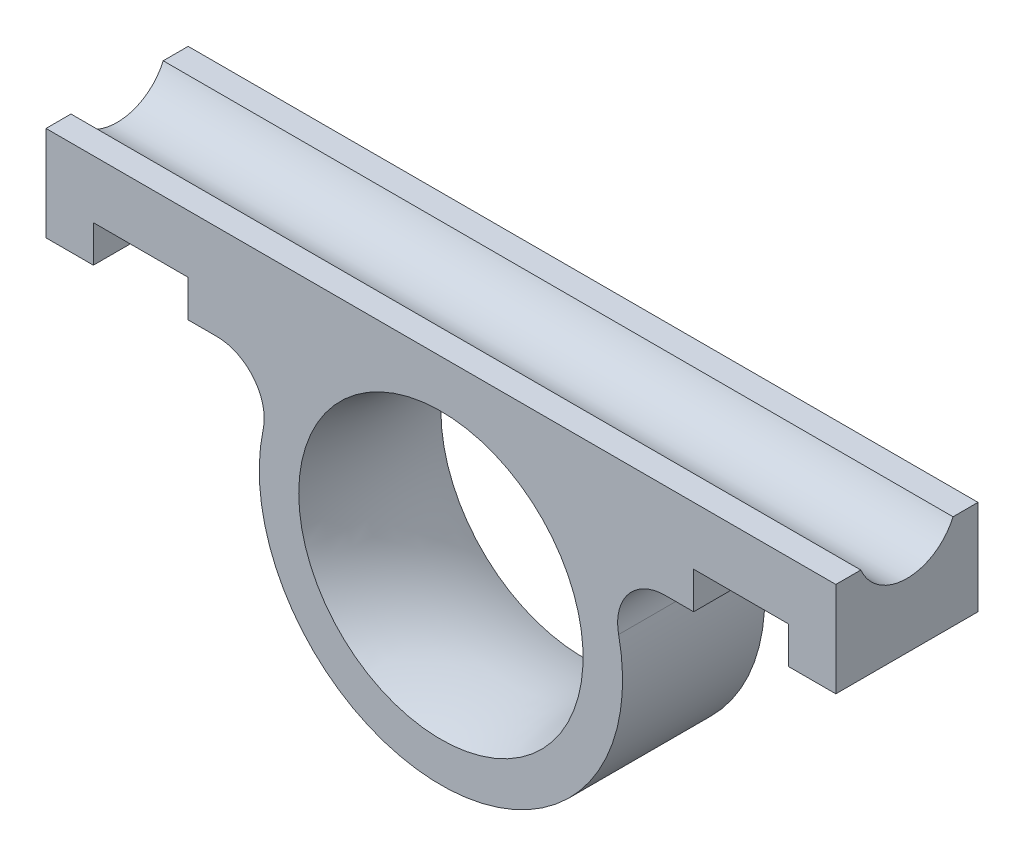
ISO-10303-21;
HEADER;
FILE_DESCRIPTION(('STEP AP214'),'2;1');
FILE_NAME('part.step','',(''),(''),'','','');
FILE_SCHEMA(('AUTOMOTIVE_DESIGN { 1 0 10303 214 1 1 1 1 }'));
ENDSEC;
DATA;
#1=APPLICATION_CONTEXT('core data for automotive mechanical design processes');
#2=APPLICATION_PROTOCOL_DEFINITION('international standard','automotive_design',2000,#1);
#3=PRODUCT_CONTEXT('',#1,'mechanical');
#4=PRODUCT('Part','Part','',(#3));
#5=PRODUCT_RELATED_PRODUCT_CATEGORY('part','',(#4));
#6=PRODUCT_DEFINITION_FORMATION('','',#4);
#7=PRODUCT_DEFINITION_CONTEXT('part definition',#1,'design');
#8=PRODUCT_DEFINITION('design','',#6,#7);
#9=PRODUCT_DEFINITION_SHAPE('','',#8);
#10=(LENGTH_UNIT() NAMED_UNIT(*) SI_UNIT(.MILLI.,.METRE.));
#11=(NAMED_UNIT(*) PLANE_ANGLE_UNIT() SI_UNIT($,.RADIAN.));
#12=(NAMED_UNIT(*) SI_UNIT($,.STERADIAN.) SOLID_ANGLE_UNIT());
#13=UNCERTAINTY_MEASURE_WITH_UNIT(LENGTH_MEASURE(1.E-05),#10,'distance_accuracy_value','');
#14=(GEOMETRIC_REPRESENTATION_CONTEXT(3) GLOBAL_UNCERTAINTY_ASSIGNED_CONTEXT((#13)) GLOBAL_UNIT_ASSIGNED_CONTEXT((#10,
#11,#12)) REPRESENTATION_CONTEXT('',''));
#15=CARTESIAN_POINT('',(0.,0.,0.));
#16=DIRECTION('',(0.,0.,1.));
#17=DIRECTION('',(1.,0.,0.));
#18=AXIS2_PLACEMENT_3D('',#15,#16,#17);
#19=CARTESIAN_POINT('',(-14.1862609591111,3.,9.));
#20=DIRECTION('',(0.,0.,1.));
#21=DIRECTION('',(1.,0.,0.));
#22=AXIS2_PLACEMENT_3D('',#19,#20,#21);
#23=PLANE('',#22);
#24=CARTESIAN_POINT('',(0.,0.,9.));
#25=DIRECTION('',(0.,0.,-1.));
#26=DIRECTION('',(-1.,0.,0.));
#27=AXIS2_PLACEMENT_3D('',#24,#25,#26);
#28=CIRCLE('',#27,9.);
#29=CARTESIAN_POINT('',(-9.,0.,9.));
#30=VERTEX_POINT('',#29);
#31=EDGE_CURVE('E275',#30,#30,#28,.T.);
#32=ORIENTED_EDGE('',*,*,#31,.T.);
#33=EDGE_LOOP('',(#32));
#34=FACE_BOUND('',#33,.T.);
#35=DIRECTION('',(-1.,0.,0.));
#36=VECTOR('',#35,1.);
#37=CARTESIAN_POINT('',(31.2980546704707,8.33534165703035,9.));
#38=LINE('',#37,#36);
#39=CARTESIAN_POINT('',(22.,8.33534165703035,9.));
#40=VERTEX_POINT('',#39);
#41=CARTESIAN_POINT('',(16.,8.33534165703035,9.));
#42=VERTEX_POINT('',#41);
#43=EDGE_CURVE('E261',#40,#42,#38,.T.);
#44=ORIENTED_EDGE('',*,*,#43,.F.);
#45=DIRECTION('',(0.,-1.,0.));
#46=VECTOR('',#45,1.);
#47=CARTESIAN_POINT('',(22.,7.00000000000001,9.));
#48=LINE('',#47,#46);
#49=CARTESIAN_POINT('',(22.,6.00000000000001,9.));
#50=VERTEX_POINT('',#49);
#51=EDGE_CURVE('E145',#40,#50,#48,.T.);
#52=ORIENTED_EDGE('',*,*,#51,.T.);
#53=DIRECTION('',(1.,0.,0.));
#54=VECTOR('',#53,1.);
#55=CARTESIAN_POINT('',(22.,6.00000000000001,9.));
#56=LINE('',#55,#54);
#57=CARTESIAN_POINT('',(25.,6.00000000000001,9.));
#58=VERTEX_POINT('',#57);
#59=EDGE_CURVE('E138',#50,#58,#56,.T.);
#60=ORIENTED_EDGE('',*,*,#59,.T.);
#61=DIRECTION('',(0.,1.,0.));
#62=VECTOR('',#61,1.);
#63=CARTESIAN_POINT('',(25.,12.,9.));
#64=LINE('',#63,#62);
#65=CARTESIAN_POINT('',(25.,12.,9.));
#66=VERTEX_POINT('',#65);
#67=EDGE_CURVE('E142',#58,#66,#64,.T.);
#68=ORIENTED_EDGE('',*,*,#67,.T.);
#69=DIRECTION('',(-1.,0.,0.));
#70=VECTOR('',#69,1.);
#71=CARTESIAN_POINT('',(-25.,12.,9.));
#72=LINE('',#71,#70);
#73=CARTESIAN_POINT('',(-25.,12.,9.));
#74=VERTEX_POINT('',#73);
#75=EDGE_CURVE('E57',#66,#74,#72,.T.);
#76=ORIENTED_EDGE('',*,*,#75,.T.);
#77=DIRECTION('',(0.,-1.,0.));
#78=VECTOR('',#77,1.);
#79=CARTESIAN_POINT('',(-25.,12.,9.));
#80=LINE('',#79,#78);
#81=CARTESIAN_POINT('',(-25.,6.,9.));
#82=VERTEX_POINT('',#81);
#83=EDGE_CURVE('E198',#74,#82,#80,.T.);
#84=ORIENTED_EDGE('',*,*,#83,.T.);
#85=DIRECTION('',(1.,0.,0.));
#86=VECTOR('',#85,1.);
#87=CARTESIAN_POINT('',(-25.,6.,9.));
#88=LINE('',#87,#86);
#89=CARTESIAN_POINT('',(-22.,6.,9.));
#90=VERTEX_POINT('',#89);
#91=EDGE_CURVE('E111',#82,#90,#88,.T.);
#92=ORIENTED_EDGE('',*,*,#91,.T.);
#93=DIRECTION('',(0.,1.,0.));
#94=VECTOR('',#93,1.);
#95=CARTESIAN_POINT('',(-22.,6.,9.));
#96=LINE('',#95,#94);
#97=CARTESIAN_POINT('',(-22.,8.33534165703034,9.));
#98=VERTEX_POINT('',#97);
#99=EDGE_CURVE('E234',#90,#98,#96,.T.);
#100=ORIENTED_EDGE('',*,*,#99,.T.);
#101=DIRECTION('',(-1.,0.,0.));
#102=VECTOR('',#101,1.);
#103=CARTESIAN_POINT('',(23.0812579761706,8.33534165703042,9.));
#104=LINE('',#103,#102);
#105=CARTESIAN_POINT('',(-16.,8.33534165703035,9.));
#106=VERTEX_POINT('',#105);
#107=EDGE_CURVE('E295',#106,#98,#104,.T.);
#108=ORIENTED_EDGE('',*,*,#107,.F.);
#109=DIRECTION('',(0.,-1.,0.));
#110=VECTOR('',#109,1.);
#111=CARTESIAN_POINT('',(-16.,7.,9.));
#112=LINE('',#111,#110);
#113=CARTESIAN_POINT('',(-16.,6.,9.));
#114=VERTEX_POINT('',#113);
#115=EDGE_CURVE('E242',#106,#114,#112,.T.);
#116=ORIENTED_EDGE('',*,*,#115,.T.);
#117=DIRECTION('',(1.,0.,0.));
#118=VECTOR('',#117,1.);
#119=CARTESIAN_POINT('',(-16.,6.,9.));
#120=LINE('',#119,#118);
#121=CARTESIAN_POINT('',(-14.1862609591111,6.,9.));
#122=VERTEX_POINT('',#121);
#123=EDGE_CURVE('E244',#114,#122,#120,.T.);
#124=ORIENTED_EDGE('',*,*,#123,.T.);
#125=CARTESIAN_POINT('',(-14.1862609591111,3.,9.));
#126=DIRECTION('',(0.,0.,-1.));
#127=DIRECTION('',(1.,0.,0.));
#128=AXIS2_PLACEMENT_3D('',#125,#126,#127);
#129=CIRCLE('',#128,3.);
#130=CARTESIAN_POINT('',(-11.2511724848123,2.37931034482759,9.));
#131=VERTEX_POINT('',#130);
#132=EDGE_CURVE('E246',#122,#131,#129,.T.);
#133=ORIENTED_EDGE('',*,*,#132,.T.);
#134=CARTESIAN_POINT('',(0.,0.,9.));
#135=DIRECTION('',(0.,0.,1.));
#136=DIRECTION('',(1.,0.,0.));
#137=AXIS2_PLACEMENT_3D('',#134,#135,#136);
#138=CIRCLE('',#137,11.5);
#139=CARTESIAN_POINT('',(11.2511724848123,2.37931034482759,9.));
#140=VERTEX_POINT('',#139);
#141=EDGE_CURVE('E248',#131,#140,#138,.T.);
#142=ORIENTED_EDGE('',*,*,#141,.T.);
#143=CARTESIAN_POINT('',(14.1862609591111,3.,9.));
#144=DIRECTION('',(0.,0.,-1.));
#145=DIRECTION('',(1.,0.,0.));
#146=AXIS2_PLACEMENT_3D('',#143,#144,#145);
#147=CIRCLE('',#146,3.);
#148=CARTESIAN_POINT('',(14.1862609591111,6.,9.));
#149=VERTEX_POINT('',#148);
#150=EDGE_CURVE('E250',#140,#149,#147,.T.);
#151=ORIENTED_EDGE('',*,*,#150,.T.);
#152=DIRECTION('',(1.,0.,0.));
#153=VECTOR('',#152,1.);
#154=CARTESIAN_POINT('',(14.1862609591111,6.,9.));
#155=LINE('',#154,#153);
#156=CARTESIAN_POINT('',(16.,6.,9.));
#157=VERTEX_POINT('',#156);
#158=EDGE_CURVE('E252',#149,#157,#155,.T.);
#159=ORIENTED_EDGE('',*,*,#158,.T.);
#160=DIRECTION('',(0.,1.,0.));
#161=VECTOR('',#160,1.);
#162=CARTESIAN_POINT('',(16.,6.,9.));
#163=LINE('',#162,#161);
#164=EDGE_CURVE('E254',#157,#42,#163,.T.);
#165=ORIENTED_EDGE('',*,*,#164,.T.);
#166=EDGE_LOOP('',(#44,#52,#60,#68,#76,#84,#92,#100,#108,#116,#124,#133,#142,#151,#159,#165));
#167=FACE_BOUND('',#166,.T.);
#168=ADVANCED_FACE('F33',(#34,#167),#23,.T.);
#169=CARTESIAN_POINT('',(-14.1862609591111,3.,0.));
#170=DIRECTION('',(0.,0.,1.));
#171=DIRECTION('',(1.,0.,0.));
#172=AXIS2_PLACEMENT_3D('',#169,#170,#171);
#173=PLANE('',#172);
#174=CARTESIAN_POINT('',(0.,0.,0.));
#175=DIRECTION('',(0.,0.,-1.));
#176=DIRECTION('',(-1.,0.,0.));
#177=AXIS2_PLACEMENT_3D('',#174,#175,#176);
#178=CIRCLE('',#177,9.);
#179=CARTESIAN_POINT('',(-9.,0.,0.));
#180=VERTEX_POINT('',#179);
#181=EDGE_CURVE('E415',#180,#180,#178,.T.);
#182=ORIENTED_EDGE('',*,*,#181,.F.);
#183=EDGE_LOOP('',(#182));
#184=FACE_BOUND('',#183,.T.);
#185=DIRECTION('',(0.,-1.,0.));
#186=VECTOR('',#185,1.);
#187=CARTESIAN_POINT('',(22.,7.00000000000001,0.));
#188=LINE('',#187,#186);
#189=CARTESIAN_POINT('',(22.,8.33534165703035,0.));
#190=VERTEX_POINT('',#189);
#191=CARTESIAN_POINT('',(22.,6.00000000000001,0.));
#192=VERTEX_POINT('',#191);
#193=EDGE_CURVE('E191',#190,#192,#188,.T.);
#194=ORIENTED_EDGE('',*,*,#193,.F.);
#195=DIRECTION('',(-1.,0.,0.));
#196=VECTOR('',#195,1.);
#197=CARTESIAN_POINT('',(31.2980546704707,8.33534165703035,0.));
#198=LINE('',#197,#196);
#199=CARTESIAN_POINT('',(16.,8.33534165703035,0.));
#200=VERTEX_POINT('',#199);
#201=EDGE_CURVE('E282',#190,#200,#198,.T.);
#202=ORIENTED_EDGE('',*,*,#201,.T.);
#203=DIRECTION('',(0.,1.,0.));
#204=VECTOR('',#203,1.);
#205=CARTESIAN_POINT('',(16.,6.,0.));
#206=LINE('',#205,#204);
#207=CARTESIAN_POINT('',(16.,6.,0.));
#208=VERTEX_POINT('',#207);
#209=EDGE_CURVE('E188',#208,#200,#206,.T.);
#210=ORIENTED_EDGE('',*,*,#209,.F.);
#211=DIRECTION('',(1.,0.,0.));
#212=VECTOR('',#211,1.);
#213=CARTESIAN_POINT('',(14.1862609591111,6.,0.));
#214=LINE('',#213,#212);
#215=CARTESIAN_POINT('',(14.1862609591111,6.,0.));
#216=VERTEX_POINT('',#215);
#217=EDGE_CURVE('E186',#216,#208,#214,.T.);
#218=ORIENTED_EDGE('',*,*,#217,.F.);
#219=CARTESIAN_POINT('',(14.1862609591111,3.,0.));
#220=DIRECTION('',(0.,0.,-1.));
#221=DIRECTION('',(1.,0.,0.));
#222=AXIS2_PLACEMENT_3D('',#219,#220,#221);
#223=CIRCLE('',#222,3.);
#224=CARTESIAN_POINT('',(11.2511724848123,2.37931034482759,0.));
#225=VERTEX_POINT('',#224);
#226=EDGE_CURVE('E184',#225,#216,#223,.T.);
#227=ORIENTED_EDGE('',*,*,#226,.F.);
#228=CARTESIAN_POINT('',(0.,0.,0.));
#229=DIRECTION('',(0.,0.,1.));
#230=DIRECTION('',(1.,0.,0.));
#231=AXIS2_PLACEMENT_3D('',#228,#229,#230);
#232=CIRCLE('',#231,11.5);
#233=CARTESIAN_POINT('',(-11.2511724848123,2.37931034482759,0.));
#234=VERTEX_POINT('',#233);
#235=EDGE_CURVE('E182',#234,#225,#232,.T.);
#236=ORIENTED_EDGE('',*,*,#235,.F.);
#237=CARTESIAN_POINT('',(-14.1862609591111,3.,0.));
#238=DIRECTION('',(0.,0.,-1.));
#239=DIRECTION('',(1.,0.,0.));
#240=AXIS2_PLACEMENT_3D('',#237,#238,#239);
#241=CIRCLE('',#240,3.);
#242=CARTESIAN_POINT('',(-14.1862609591111,6.,0.));
#243=VERTEX_POINT('',#242);
#244=EDGE_CURVE('E180',#243,#234,#241,.T.);
#245=ORIENTED_EDGE('',*,*,#244,.F.);
#246=DIRECTION('',(1.,0.,0.));
#247=VECTOR('',#246,1.);
#248=CARTESIAN_POINT('',(-16.,6.,0.));
#249=LINE('',#248,#247);
#250=CARTESIAN_POINT('',(-16.,6.,0.));
#251=VERTEX_POINT('',#250);
#252=EDGE_CURVE('E178',#251,#243,#249,.T.);
#253=ORIENTED_EDGE('',*,*,#252,.F.);
#254=DIRECTION('',(0.,-1.,0.));
#255=VECTOR('',#254,1.);
#256=CARTESIAN_POINT('',(-16.,7.,0.));
#257=LINE('',#256,#255);
#258=CARTESIAN_POINT('',(-16.,8.33534165703035,0.));
#259=VERTEX_POINT('',#258);
#260=EDGE_CURVE('E176',#259,#251,#257,.T.);
#261=ORIENTED_EDGE('',*,*,#260,.F.);
#262=DIRECTION('',(-1.,0.,0.));
#263=VECTOR('',#262,1.);
#264=CARTESIAN_POINT('',(23.0812579761706,8.33534165703042,0.));
#265=LINE('',#264,#263);
#266=CARTESIAN_POINT('',(-22.,8.33534165703034,0.));
#267=VERTEX_POINT('',#266);
#268=EDGE_CURVE('E290',#259,#267,#265,.T.);
#269=ORIENTED_EDGE('',*,*,#268,.T.);
#270=DIRECTION('',(0.,1.,0.));
#271=VECTOR('',#270,1.);
#272=CARTESIAN_POINT('',(-22.,6.,0.));
#273=LINE('',#272,#271);
#274=CARTESIAN_POINT('',(-22.,6.,0.));
#275=VERTEX_POINT('',#274);
#276=EDGE_CURVE('E173',#275,#267,#273,.T.);
#277=ORIENTED_EDGE('',*,*,#276,.F.);
#278=DIRECTION('',(1.,0.,0.));
#279=VECTOR('',#278,1.);
#280=CARTESIAN_POINT('',(-25.,6.,0.));
#281=LINE('',#280,#279);
#282=CARTESIAN_POINT('',(-25.,6.,0.));
#283=VERTEX_POINT('',#282);
#284=EDGE_CURVE('E171',#283,#275,#281,.T.);
#285=ORIENTED_EDGE('',*,*,#284,.F.);
#286=DIRECTION('',(0.,-1.,0.));
#287=VECTOR('',#286,1.);
#288=CARTESIAN_POINT('',(-25.,12.,0.));
#289=LINE('',#288,#287);
#290=CARTESIAN_POINT('',(-25.,12.,0.));
#291=VERTEX_POINT('',#290);
#292=EDGE_CURVE('E169',#291,#283,#289,.T.);
#293=ORIENTED_EDGE('',*,*,#292,.F.);
#294=DIRECTION('',(-1.,0.,0.));
#295=VECTOR('',#294,1.);
#296=CARTESIAN_POINT('',(-25.,12.,0.));
#297=LINE('',#296,#295);
#298=CARTESIAN_POINT('',(25.,12.,0.));
#299=VERTEX_POINT('',#298);
#300=EDGE_CURVE('E196',#299,#291,#297,.T.);
#301=ORIENTED_EDGE('',*,*,#300,.F.);
#302=DIRECTION('',(0.,1.,0.));
#303=VECTOR('',#302,1.);
#304=CARTESIAN_POINT('',(25.,12.,0.));
#305=LINE('',#304,#303);
#306=CARTESIAN_POINT('',(25.,6.00000000000001,0.));
#307=VERTEX_POINT('',#306);
#308=EDGE_CURVE('E194',#307,#299,#305,.T.);
#309=ORIENTED_EDGE('',*,*,#308,.F.);
#310=DIRECTION('',(1.,0.,0.));
#311=VECTOR('',#310,1.);
#312=CARTESIAN_POINT('',(22.,6.00000000000001,0.));
#313=LINE('',#312,#311);
#314=EDGE_CURVE('E154',#192,#307,#313,.T.);
#315=ORIENTED_EDGE('',*,*,#314,.F.);
#316=EDGE_LOOP('',(#194,#202,#210,#218,#227,#236,#245,#253,#261,#269,#277,#285,#293,#301,#309,#315));
#317=FACE_BOUND('',#316,.T.);
#318=ADVANCED_FACE('F305',(#184,#317),#173,.F.);
#319=CARTESIAN_POINT('',(-25.,12.,9.));
#320=DIRECTION('',(0.,-1.,0.));
#321=DIRECTION('',(1.,0.,0.));
#322=AXIS2_PLACEMENT_3D('',#319,#320,#321);
#323=PLANE('',#322);
#324=DIRECTION('',(0.,0.,-1.));
#325=VECTOR('',#324,1.);
#326=CARTESIAN_POINT('',(-25.,12.,9.));
#327=LINE('',#326,#325);
#328=CARTESIAN_POINT('',(-25.,12.,1.58141729601507));
#329=VERTEX_POINT('',#328);
#330=EDGE_CURVE('E102',#329,#291,#327,.T.);
#331=ORIENTED_EDGE('',*,*,#330,.F.);
#332=DIRECTION('',(1.,0.,0.));
#333=VECTOR('',#332,1.);
#334=CARTESIAN_POINT('',(-25.,12.,1.58141729601507));
#335=LINE('',#334,#333);
#336=CARTESIAN_POINT('',(25.,12.,1.58141729601507));
#337=VERTEX_POINT('',#336);
#338=EDGE_CURVE('E12',#329,#337,#335,.T.);
#339=ORIENTED_EDGE('',*,*,#338,.T.);
#340=DIRECTION('',(0.,0.,-1.));
#341=VECTOR('',#340,1.);
#342=CARTESIAN_POINT('',(25.,12.,9.));
#343=LINE('',#342,#341);
#344=EDGE_CURVE('E202',#337,#299,#343,.T.);
#345=ORIENTED_EDGE('',*,*,#344,.T.);
#346=ORIENTED_EDGE('',*,*,#300,.T.);
#347=EDGE_LOOP('',(#331,#339,#345,#346));
#348=FACE_BOUND('',#347,.T.);
#349=ADVANCED_FACE('F300',(#348),#323,.F.);
#350=CARTESIAN_POINT('',(-25.,12.,9.));
#351=DIRECTION('',(1.,0.,0.));
#352=DIRECTION('',(0.,0.,-1.));
#353=AXIS2_PLACEMENT_3D('',#350,#351,#352);
#354=PLANE('',#353);
#355=CARTESIAN_POINT('',(-25.,12.,7.41858270398493));
#356=VERTEX_POINT('',#355);
#357=EDGE_CURVE('E199',#74,#356,#327,.T.);
#358=ORIENTED_EDGE('',*,*,#357,.T.);
#359=CARTESIAN_POINT('',(-25.,13.25,4.5));
#360=DIRECTION('',(1.,0.,0.));
#361=DIRECTION('',(0.,0.,-1.));
#362=AXIS2_PLACEMENT_3D('',#359,#360,#361);
#363=CIRCLE('',#362,3.175);
#364=EDGE_CURVE('E48',#356,#329,#363,.T.);
#365=ORIENTED_EDGE('',*,*,#364,.T.);
#366=ORIENTED_EDGE('',*,*,#330,.T.);
#367=ORIENTED_EDGE('',*,*,#292,.T.);
#368=DIRECTION('',(0.,0.,-1.));
#369=VECTOR('',#368,1.);
#370=CARTESIAN_POINT('',(-25.,6.,9.));
#371=LINE('',#370,#369);
#372=EDGE_CURVE('E226',#82,#283,#371,.T.);
#373=ORIENTED_EDGE('',*,*,#372,.F.);
#374=ORIENTED_EDGE('',*,*,#83,.F.);
#375=EDGE_LOOP('',(#358,#365,#366,#367,#373,#374));
#376=FACE_BOUND('',#375,.T.);
#377=ADVANCED_FACE('F35',(#376),#354,.F.);
#378=CARTESIAN_POINT('',(-25.,6.,9.));
#379=DIRECTION('',(0.,1.,0.));
#380=DIRECTION('',(0.,0.,1.));
#381=AXIS2_PLACEMENT_3D('',#378,#379,#380);
#382=PLANE('',#381);
#383=ORIENTED_EDGE('',*,*,#284,.T.);
#384=DIRECTION('',(0.,0.,-1.));
#385=VECTOR('',#384,1.);
#386=CARTESIAN_POINT('',(-22.,6.,9.));
#387=LINE('',#386,#385);
#388=EDGE_CURVE('E223',#90,#275,#387,.T.);
#389=ORIENTED_EDGE('',*,*,#388,.F.);
#390=ORIENTED_EDGE('',*,*,#91,.F.);
#391=ORIENTED_EDGE('',*,*,#372,.T.);
#392=EDGE_LOOP('',(#383,#389,#390,#391));
#393=FACE_BOUND('',#392,.T.);
#394=ADVANCED_FACE('F307',(#393),#382,.F.);
#395=CARTESIAN_POINT('',(-22.,6.,9.));
#396=DIRECTION('',(-1.,0.,0.));
#397=DIRECTION('',(0.,-1.,0.));
#398=AXIS2_PLACEMENT_3D('',#395,#396,#397);
#399=PLANE('',#398);
#400=ORIENTED_EDGE('',*,*,#276,.T.);
#401=CARTESIAN_POINT('',(-22.,15.25,4.5));
#402=DIRECTION('',(1.,0.,0.));
#403=DIRECTION('',(0.,1.,0.));
#404=AXIS2_PLACEMENT_3D('',#401,#402,#403);
#405=CIRCLE('',#404,8.24999999999997);
#406=EDGE_CURVE('E287',#98,#267,#405,.T.);
#407=ORIENTED_EDGE('',*,*,#406,.F.);
#408=ORIENTED_EDGE('',*,*,#99,.F.);
#409=ORIENTED_EDGE('',*,*,#388,.T.);
#410=EDGE_LOOP('',(#400,#407,#408,#409));
#411=FACE_BOUND('',#410,.T.);
#412=ADVANCED_FACE('F309',(#411),#399,.F.);
#413=CARTESIAN_POINT('',(-16.,7.,9.));
#414=DIRECTION('',(1.,0.,0.));
#415=DIRECTION('',(0.,0.,-1.));
#416=AXIS2_PLACEMENT_3D('',#413,#414,#415);
#417=PLANE('',#416);
#418=ORIENTED_EDGE('',*,*,#260,.T.);
#419=DIRECTION('',(0.,0.,-1.));
#420=VECTOR('',#419,1.);
#421=CARTESIAN_POINT('',(-16.,6.,9.));
#422=LINE('',#421,#420);
#423=EDGE_CURVE('E220',#114,#251,#422,.T.);
#424=ORIENTED_EDGE('',*,*,#423,.F.);
#425=ORIENTED_EDGE('',*,*,#115,.F.);
#426=CARTESIAN_POINT('',(-16.,15.25,4.5));
#427=DIRECTION('',(1.,0.,0.));
#428=DIRECTION('',(0.,0.,-1.));
#429=AXIS2_PLACEMENT_3D('',#426,#427,#428);
#430=CIRCLE('',#429,8.24999999999997);
#431=EDGE_CURVE('E286',#106,#259,#430,.T.);
#432=ORIENTED_EDGE('',*,*,#431,.T.);
#433=EDGE_LOOP('',(#418,#424,#425,#432));
#434=FACE_BOUND('',#433,.T.);
#435=ADVANCED_FACE('F314',(#434),#417,.F.);
#436=CARTESIAN_POINT('',(-16.,6.,9.));
#437=DIRECTION('',(0.,1.,0.));
#438=DIRECTION('',(-1.,0.,0.));
#439=AXIS2_PLACEMENT_3D('',#436,#437,#438);
#440=PLANE('',#439);
#441=ORIENTED_EDGE('',*,*,#252,.T.);
#442=DIRECTION('',(0.,0.,-1.));
#443=VECTOR('',#442,1.);
#444=CARTESIAN_POINT('',(-14.1862609591111,6.,9.));
#445=LINE('',#444,#443);
#446=EDGE_CURVE('E217',#122,#243,#445,.T.);
#447=ORIENTED_EDGE('',*,*,#446,.F.);
#448=ORIENTED_EDGE('',*,*,#123,.F.);
#449=ORIENTED_EDGE('',*,*,#423,.T.);
#450=EDGE_LOOP('',(#441,#447,#448,#449));
#451=FACE_BOUND('',#450,.T.);
#452=ADVANCED_FACE('F356',(#451),#440,.F.);
#453=CARTESIAN_POINT('',(-14.1862609591111,3.,9.));
#454=DIRECTION('',(0.,0.,-1.));
#455=DIRECTION('',(-1.,0.,0.));
#456=AXIS2_PLACEMENT_3D('',#453,#454,#455);
#457=CYLINDRICAL_SURFACE('',#456,3.);
#458=ORIENTED_EDGE('',*,*,#244,.T.);
#459=DIRECTION('',(0.,0.,-1.));
#460=VECTOR('',#459,1.);
#461=CARTESIAN_POINT('',(-11.2511724848123,2.37931034482759,9.));
#462=LINE('',#461,#460);
#463=EDGE_CURVE('E214',#131,#234,#462,.T.);
#464=ORIENTED_EDGE('',*,*,#463,.F.);
#465=ORIENTED_EDGE('',*,*,#132,.F.);
#466=ORIENTED_EDGE('',*,*,#446,.T.);
#467=EDGE_LOOP('',(#458,#464,#465,#466));
#468=FACE_BOUND('',#467,.T.);
#469=ADVANCED_FACE('F352',(#468),#457,.F.);
#470=CARTESIAN_POINT('',(0.,0.,9.));
#471=DIRECTION('',(0.,0.,-1.));
#472=DIRECTION('',(-1.,0.,0.));
#473=AXIS2_PLACEMENT_3D('',#470,#471,#472);
#474=CYLINDRICAL_SURFACE('',#473,11.5);
#475=ORIENTED_EDGE('',*,*,#235,.T.);
#476=DIRECTION('',(0.,0.,-1.));
#477=VECTOR('',#476,1.);
#478=CARTESIAN_POINT('',(11.2511724848123,2.37931034482759,9.));
#479=LINE('',#478,#477);
#480=EDGE_CURVE('E211',#140,#225,#479,.T.);
#481=ORIENTED_EDGE('',*,*,#480,.F.);
#482=ORIENTED_EDGE('',*,*,#141,.F.);
#483=ORIENTED_EDGE('',*,*,#463,.T.);
#484=EDGE_LOOP('',(#475,#481,#482,#483));
#485=FACE_BOUND('',#484,.T.);
#486=ADVANCED_FACE('F348',(#485),#474,.T.);
#487=CARTESIAN_POINT('',(14.1862609591111,3.,9.));
#488=DIRECTION('',(0.,0.,-1.));
#489=DIRECTION('',(-1.,0.,0.));
#490=AXIS2_PLACEMENT_3D('',#487,#488,#489);
#491=CYLINDRICAL_SURFACE('',#490,3.);
#492=ORIENTED_EDGE('',*,*,#226,.T.);
#493=DIRECTION('',(0.,0.,-1.));
#494=VECTOR('',#493,1.);
#495=CARTESIAN_POINT('',(14.1862609591111,6.,9.));
#496=LINE('',#495,#494);
#497=EDGE_CURVE('E208',#149,#216,#496,.T.);
#498=ORIENTED_EDGE('',*,*,#497,.F.);
#499=ORIENTED_EDGE('',*,*,#150,.F.);
#500=ORIENTED_EDGE('',*,*,#480,.T.);
#501=EDGE_LOOP('',(#492,#498,#499,#500));
#502=FACE_BOUND('',#501,.T.);
#503=ADVANCED_FACE('F344',(#502),#491,.F.);
#504=CARTESIAN_POINT('',(14.1862609591111,6.,9.));
#505=DIRECTION('',(0.,1.,0.));
#506=DIRECTION('',(-1.,0.,0.));
#507=AXIS2_PLACEMENT_3D('',#504,#505,#506);
#508=PLANE('',#507);
#509=ORIENTED_EDGE('',*,*,#217,.T.);
#510=DIRECTION('',(0.,0.,-1.));
#511=VECTOR('',#510,1.);
#512=CARTESIAN_POINT('',(16.,6.,9.));
#513=LINE('',#512,#511);
#514=EDGE_CURVE('E205',#157,#208,#513,.T.);
#515=ORIENTED_EDGE('',*,*,#514,.F.);
#516=ORIENTED_EDGE('',*,*,#158,.F.);
#517=ORIENTED_EDGE('',*,*,#497,.T.);
#518=EDGE_LOOP('',(#509,#515,#516,#517));
#519=FACE_BOUND('',#518,.T.);
#520=ADVANCED_FACE('F341',(#519),#508,.F.);
#521=CARTESIAN_POINT('',(16.,6.,9.));
#522=DIRECTION('',(-1.,0.,0.));
#523=DIRECTION('',(0.,0.,1.));
#524=AXIS2_PLACEMENT_3D('',#521,#522,#523);
#525=PLANE('',#524);
#526=ORIENTED_EDGE('',*,*,#209,.T.);
#527=CARTESIAN_POINT('',(16.,15.25,4.5));
#528=DIRECTION('',(1.,0.,0.));
#529=DIRECTION('',(0.,0.,1.));
#530=AXIS2_PLACEMENT_3D('',#527,#528,#529);
#531=CIRCLE('',#530,8.24999999999997);
#532=EDGE_CURVE('E269',#42,#200,#531,.T.);
#533=ORIENTED_EDGE('',*,*,#532,.F.);
#534=ORIENTED_EDGE('',*,*,#164,.F.);
#535=ORIENTED_EDGE('',*,*,#514,.T.);
#536=EDGE_LOOP('',(#526,#533,#534,#535));
#537=FACE_BOUND('',#536,.T.);
#538=ADVANCED_FACE('F270',(#537),#525,.F.);
#539=CARTESIAN_POINT('',(22.,7.00000000000001,9.));
#540=DIRECTION('',(1.,0.,0.));
#541=DIRECTION('',(0.,1.,0.));
#542=AXIS2_PLACEMENT_3D('',#539,#540,#541);
#543=PLANE('',#542);
#544=ORIENTED_EDGE('',*,*,#193,.T.);
#545=DIRECTION('',(0.,0.,-1.));
#546=VECTOR('',#545,1.);
#547=CARTESIAN_POINT('',(22.,6.00000000000001,9.));
#548=LINE('',#547,#546);
#549=EDGE_CURVE('E158',#50,#192,#548,.T.);
#550=ORIENTED_EDGE('',*,*,#549,.F.);
#551=ORIENTED_EDGE('',*,*,#51,.F.);
#552=CARTESIAN_POINT('',(22.,15.25,4.5));
#553=DIRECTION('',(1.,0.,0.));
#554=DIRECTION('',(0.,1.,0.));
#555=AXIS2_PLACEMENT_3D('',#552,#553,#554);
#556=CIRCLE('',#555,8.24999999999997);
#557=EDGE_CURVE('E280',#40,#190,#556,.T.);
#558=ORIENTED_EDGE('',*,*,#557,.T.);
#559=EDGE_LOOP('',(#544,#550,#551,#558));
#560=FACE_BOUND('',#559,.T.);
#561=ADVANCED_FACE('F335',(#560),#543,.F.);
#562=CARTESIAN_POINT('',(22.,6.00000000000001,9.));
#563=DIRECTION('',(0.,1.,0.));
#564=DIRECTION('',(-1.,0.,0.));
#565=AXIS2_PLACEMENT_3D('',#562,#563,#564);
#566=PLANE('',#565);
#567=ORIENTED_EDGE('',*,*,#314,.T.);
#568=DIRECTION('',(0.,0.,-1.));
#569=VECTOR('',#568,1.);
#570=CARTESIAN_POINT('',(25.,6.00000000000001,9.));
#571=LINE('',#570,#569);
#572=EDGE_CURVE('E151',#58,#307,#571,.T.);
#573=ORIENTED_EDGE('',*,*,#572,.F.);
#574=ORIENTED_EDGE('',*,*,#59,.F.);
#575=ORIENTED_EDGE('',*,*,#549,.T.);
#576=EDGE_LOOP('',(#567,#573,#574,#575));
#577=FACE_BOUND('',#576,.T.);
#578=ADVANCED_FACE('F152',(#577),#566,.F.);
#579=CARTESIAN_POINT('',(25.,12.,9.));
#580=DIRECTION('',(-1.,0.,0.));
#581=DIRECTION('',(0.,0.,1.));
#582=AXIS2_PLACEMENT_3D('',#579,#580,#581);
#583=PLANE('',#582);
#584=ORIENTED_EDGE('',*,*,#344,.F.);
#585=CARTESIAN_POINT('',(25.,13.25,4.5));
#586=DIRECTION('',(1.,0.,0.));
#587=DIRECTION('',(0.,0.,-1.));
#588=AXIS2_PLACEMENT_3D('',#585,#586,#587);
#589=CIRCLE('',#588,3.175);
#590=CARTESIAN_POINT('',(25.,12.,7.41858270398493));
#591=VERTEX_POINT('',#590);
#592=EDGE_CURVE('E237',#591,#337,#589,.T.);
#593=ORIENTED_EDGE('',*,*,#592,.F.);
#594=EDGE_CURVE('E159',#66,#591,#343,.T.);
#595=ORIENTED_EDGE('',*,*,#594,.F.);
#596=ORIENTED_EDGE('',*,*,#67,.F.);
#597=ORIENTED_EDGE('',*,*,#572,.T.);
#598=ORIENTED_EDGE('',*,*,#308,.T.);
#599=EDGE_LOOP('',(#584,#593,#595,#596,#597,#598));
#600=FACE_BOUND('',#599,.T.);
#601=ADVANCED_FACE('F162',(#600),#583,.F.);
#602=ORIENTED_EDGE('',*,*,#594,.T.);
#603=DIRECTION('',(1.,0.,0.));
#604=VECTOR('',#603,1.);
#605=CARTESIAN_POINT('',(-25.,12.,7.41858270398493));
#606=LINE('',#605,#604);
#607=EDGE_CURVE('E41',#591,#356,#606,.F.);
#608=ORIENTED_EDGE('',*,*,#607,.T.);
#609=ORIENTED_EDGE('',*,*,#357,.F.);
#610=ORIENTED_EDGE('',*,*,#75,.F.);
#611=EDGE_LOOP('',(#602,#608,#609,#610));
#612=FACE_BOUND('',#611,.T.);
#613=ADVANCED_FACE('F228',(#612),#323,.F.);
#614=CARTESIAN_POINT('',(-25.,13.25,4.5));
#615=DIRECTION('',(1.,0.,0.));
#616=DIRECTION('',(0.,0.,-1.));
#617=AXIS2_PLACEMENT_3D('',#614,#615,#616);
#618=CYLINDRICAL_SURFACE('',#617,3.175);
#619=ORIENTED_EDGE('',*,*,#364,.F.);
#620=ORIENTED_EDGE('',*,*,#607,.F.);
#621=ORIENTED_EDGE('',*,*,#592,.T.);
#622=ORIENTED_EDGE('',*,*,#338,.F.);
#623=EDGE_LOOP('',(#619,#620,#621,#622));
#624=FACE_BOUND('',#623,.T.);
#625=ADVANCED_FACE('F298',(#624),#618,.F.);
#626=CARTESIAN_POINT('',(23.0812579761706,15.2500000000001,4.5));
#627=DIRECTION('',(-1.,0.,0.));
#628=DIRECTION('',(0.,-1.,0.));
#629=AXIS2_PLACEMENT_3D('',#626,#627,#628);
#630=CYLINDRICAL_SURFACE('',#629,8.24999999999997);
#631=ORIENTED_EDGE('',*,*,#431,.F.);
#632=ORIENTED_EDGE('',*,*,#107,.T.);
#633=ORIENTED_EDGE('',*,*,#406,.T.);
#634=ORIENTED_EDGE('',*,*,#268,.F.);
#635=EDGE_LOOP('',(#631,#632,#633,#634));
#636=FACE_BOUND('',#635,.T.);
#637=ADVANCED_FACE('F387',(#636),#630,.T.);
#638=CARTESIAN_POINT('',(31.2980546704707,15.25,4.5));
#639=DIRECTION('',(-1.,0.,0.));
#640=DIRECTION('',(0.,0.,1.));
#641=AXIS2_PLACEMENT_3D('',#638,#639,#640);
#642=CYLINDRICAL_SURFACE('',#641,8.24999999999997);
#643=ORIENTED_EDGE('',*,*,#532,.T.);
#644=ORIENTED_EDGE('',*,*,#201,.F.);
#645=ORIENTED_EDGE('',*,*,#557,.F.);
#646=ORIENTED_EDGE('',*,*,#43,.T.);
#647=EDGE_LOOP('',(#643,#644,#645,#646));
#648=FACE_BOUND('',#647,.T.);
#649=ADVANCED_FACE('F278',(#648),#642,.T.);
#650=CARTESIAN_POINT('',(0.,0.,4.5));
#651=DIRECTION('',(0.,0.,-1.));
#652=DIRECTION('',(-1.,0.,0.));
#653=AXIS2_PLACEMENT_3D('',#650,#651,#652);
#654=TOROIDAL_SURFACE('',#653,22.125,13.875);
#655=ORIENTED_EDGE('',*,*,#181,.T.);
#656=EDGE_LOOP('',(#655));
#657=FACE_BOUND('',#656,.T.);
#658=ORIENTED_EDGE('',*,*,#31,.F.);
#659=EDGE_LOOP('',(#658));
#660=FACE_BOUND('',#659,.T.);
#661=ADVANCED_FACE('F405',(#657,#660),#654,.T.);
#662=CLOSED_SHELL('',(#168,#318,#349,#377,#394,#412,#435,#452,#469,#486,#503,#520,#538,#561,
#578,#601,#613,#625,#637,#649,#661));
#663=MANIFOLD_SOLID_BREP('B2',#662);
#664=ADVANCED_BREP_SHAPE_REPRESENTATION('',(#18,#663),#14);
#665=SHAPE_DEFINITION_REPRESENTATION(#9,#664);
ENDSEC;
END-ISO-10303-21;
